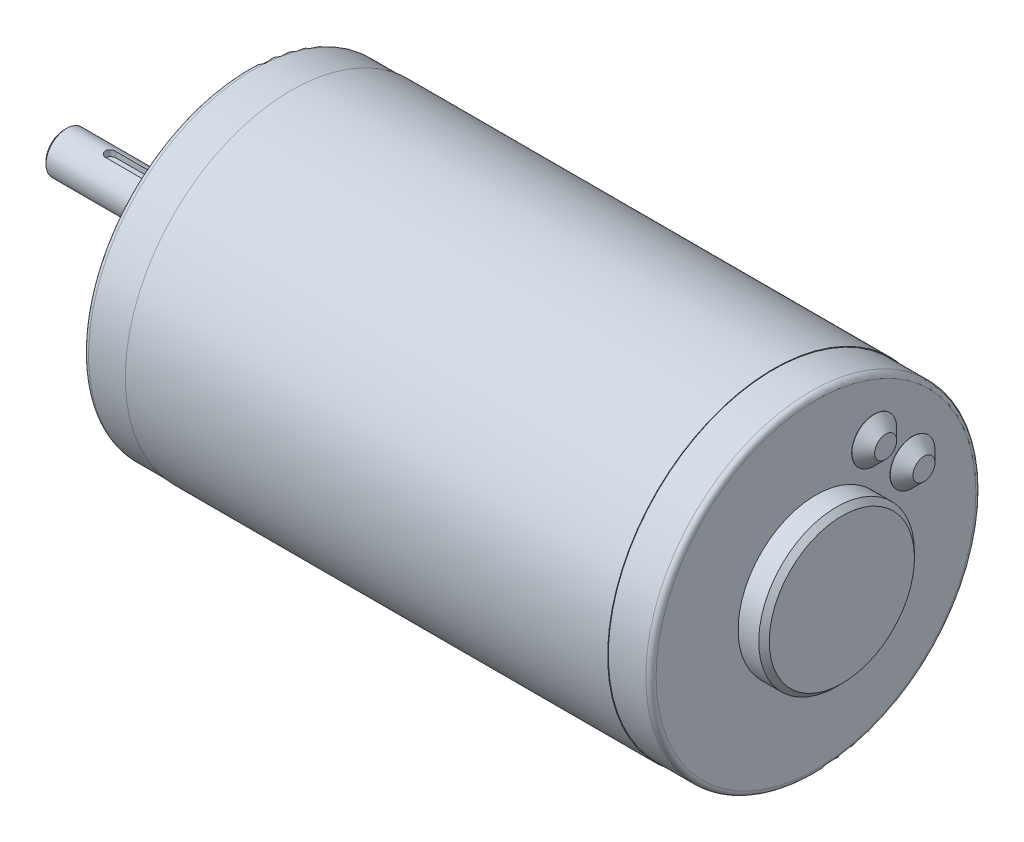
ISO-10303-21;
HEADER;
FILE_DESCRIPTION(('STEP AP214'),'2;1');
FILE_NAME('part.step','',(''),(''),'','','');
FILE_SCHEMA(('AUTOMOTIVE_DESIGN { 1 0 10303 214 1 1 1 1 }'));
ENDSEC;
DATA;
#1=APPLICATION_CONTEXT('core data for automotive mechanical design processes');
#2=APPLICATION_PROTOCOL_DEFINITION('international standard','automotive_design',2000,#1);
#3=PRODUCT_CONTEXT('',#1,'mechanical');
#4=PRODUCT('Part','Part','',(#3));
#5=PRODUCT_RELATED_PRODUCT_CATEGORY('part','',(#4));
#6=PRODUCT_DEFINITION_FORMATION('','',#4);
#7=PRODUCT_DEFINITION_CONTEXT('part definition',#1,'design');
#8=PRODUCT_DEFINITION('design','',#6,#7);
#9=PRODUCT_DEFINITION_SHAPE('','',#8);
#10=(LENGTH_UNIT() NAMED_UNIT(*) SI_UNIT(.MILLI.,.METRE.));
#11=(NAMED_UNIT(*) PLANE_ANGLE_UNIT() SI_UNIT($,.RADIAN.));
#12=(NAMED_UNIT(*) SI_UNIT($,.STERADIAN.) SOLID_ANGLE_UNIT());
#13=UNCERTAINTY_MEASURE_WITH_UNIT(LENGTH_MEASURE(1.E-05),#10,'distance_accuracy_value','');
#14=(GEOMETRIC_REPRESENTATION_CONTEXT(3) GLOBAL_UNCERTAINTY_ASSIGNED_CONTEXT((#13)) GLOBAL_UNIT_ASSIGNED_CONTEXT((#10,
#11,#12)) REPRESENTATION_CONTEXT('',''));
#15=CARTESIAN_POINT('',(0.,0.,0.));
#16=DIRECTION('',(0.,0.,1.));
#17=DIRECTION('',(1.,0.,0.));
#18=AXIS2_PLACEMENT_3D('',#15,#16,#17);
#19=CARTESIAN_POINT('',(-27.6,2.79999999999999,-1.));
#20=DIRECTION('',(0.,-1.,0.));
#21=DIRECTION('',(0.,0.,-1.));
#22=AXIS2_PLACEMENT_3D('',#19,#20,#21);
#23=PLANE('',#22);
#24=CARTESIAN_POINT('',(-7.1,2.79999999999999,0.));
#25=DIRECTION('',(0.,1.,0.));
#26=DIRECTION('',(0.,0.,1.));
#27=AXIS2_PLACEMENT_3D('',#24,#25,#26);
#28=CIRCLE('',#27,1.);
#29=CARTESIAN_POINT('',(-7.1,2.79999999999999,1.));
#30=VERTEX_POINT('',#29);
#31=CARTESIAN_POINT('',(-7.1,2.79999999999999,-1.));
#32=VERTEX_POINT('',#31);
#33=EDGE_CURVE('E80',#30,#32,#28,.T.);
#34=ORIENTED_EDGE('',*,*,#33,.T.);
#35=DIRECTION('',(1.,0.,0.));
#36=VECTOR('',#35,1.);
#37=CARTESIAN_POINT('',(-27.6,2.79999999999999,-1.));
#38=LINE('',#37,#36);
#39=CARTESIAN_POINT('',(-26.6,2.79999999999999,-1.));
#40=VERTEX_POINT('',#39);
#41=EDGE_CURVE('E75',#40,#32,#38,.T.);
#42=ORIENTED_EDGE('',*,*,#41,.F.);
#43=CARTESIAN_POINT('',(-26.6,2.79999999999999,0.));
#44=DIRECTION('',(0.,-1.,0.));
#45=DIRECTION('',(0.,0.,-1.));
#46=AXIS2_PLACEMENT_3D('',#43,#44,#45);
#47=CIRCLE('',#46,1.);
#48=CARTESIAN_POINT('',(-26.6,2.79999999999999,1.));
#49=VERTEX_POINT('',#48);
#50=EDGE_CURVE('E77',#40,#49,#47,.F.);
#51=ORIENTED_EDGE('',*,*,#50,.T.);
#52=DIRECTION('',(1.,0.,0.));
#53=VECTOR('',#52,1.);
#54=CARTESIAN_POINT('',(-27.6,2.79999999999999,1.));
#55=LINE('',#54,#53);
#56=EDGE_CURVE('E103',#49,#30,#55,.T.);
#57=ORIENTED_EDGE('',*,*,#56,.T.);
#58=EDGE_LOOP('',(#34,#42,#51,#57));
#59=FACE_BOUND('',#58,.T.);
#60=ADVANCED_FACE('F17',(#59),#23,.F.);
#61=CARTESIAN_POINT('',(-35.6,0.,0.));
#62=DIRECTION('',(-1.,0.,0.));
#63=DIRECTION('',(0.,0.,1.));
#64=AXIS2_PLACEMENT_3D('',#61,#62,#63);
#65=PLANE('',#64);
#66=CARTESIAN_POINT('',(-35.6000000000449,0.,0.));
#67=DIRECTION('',(1.,0.,0.));
#68=DIRECTION('',(0.,0.,-1.));
#69=AXIS2_PLACEMENT_3D('',#66,#67,#68);
#70=CIRCLE('',#69,3.49999999997408);
#71=CARTESIAN_POINT('',(-35.6000000000449,0.,-3.49999999997408));
#72=VERTEX_POINT('',#71);
#73=EDGE_CURVE('E325',#72,#72,#70,.T.);
#74=ORIENTED_EDGE('',*,*,#73,.F.);
#75=EDGE_LOOP('',(#74));
#76=FACE_BOUND('',#75,.T.);
#77=ADVANCED_FACE('F576',(#76),#65,.T.);
#78=CARTESIAN_POINT('',(-26.6,3.87298334620741,0.));
#79=DIRECTION('',(0.,-1.,0.));
#80=DIRECTION('',(0.,0.,-1.));
#81=AXIS2_PLACEMENT_3D('',#78,#79,#80);
#82=CYLINDRICAL_SURFACE('',#81,1.);
#83=CARTESIAN_POINT('',(-26.6,3.87298334620741,1.));
#84=CARTESIAN_POINT('',(-26.6276629851065,3.87298148580177,1.00000033749611));
#85=CARTESIAN_POINT('',(-26.6553122630182,3.8732800994947,0.998851407375366));
#86=CARTESIAN_POINT('',(-26.7104040353036,3.87445904774558,0.994271295395754));
#87=CARTESIAN_POINT('',(-26.7378465636871,3.87533928441687,0.99084049757268));
#88=CARTESIAN_POINT('',(-26.8194531732088,3.87881710972053,0.977175239382527));
#89=CARTESIAN_POINT('',(-26.8730564684822,3.88225203148808,0.963567695172493));
#90=CARTESIAN_POINT('',(-26.977124673782,3.89095422588002,0.927798076247996));
#91=CARTESIAN_POINT('',(-27.0275898782129,3.89622132630929,0.905636805423835));
#92=CARTESIAN_POINT('',(-27.1241114486473,3.90799134471939,0.853415378025865));
#93=CARTESIAN_POINT('',(-27.170166627891,3.91449459395647,0.823353103356933));
#94=CARTESIAN_POINT('',(-27.2575438819061,3.92816262398025,0.755484471828068));
#95=CARTESIAN_POINT('',(-27.2987548862455,3.93533791028915,0.717537268783974));
#96=CARTESIAN_POINT('',(-27.3743020894827,3.94945104396193,0.635275780516228));
#97=CARTESIAN_POINT('',(-27.4086371894679,3.95638885322537,0.590960479478829));
#98=CARTESIAN_POINT('',(-27.4699110016186,3.96936182283248,0.496456899401689));
#99=CARTESIAN_POINT('',(-27.496739895984,3.9753830468173,0.446195340334472));
#100=CARTESIAN_POINT('',(-27.5415247341967,3.98572346250588,0.341702590842916));
#101=CARTESIAN_POINT('',(-27.5594824242998,3.990042989147,0.287472184083007));
#102=CARTESIAN_POINT('',(-27.5856589927774,3.99641900005128,0.177744108525158));
#103=CARTESIAN_POINT('',(-27.5940676724228,3.998519529013,0.122294322002856));
#104=CARTESIAN_POINT('',(-27.6015033715433,4.00037438150815,0.0107327756816783));
#105=CARTESIAN_POINT('',(-27.6005315701923,4.00012899993444,-0.0453789000287066));
#106=CARTESIAN_POINT('',(-27.5893700363145,3.99735237365735,-0.155352492972097));
#107=CARTESIAN_POINT('',(-27.5793853834005,3.9948719867736,-0.209236701739855));
#108=CARTESIAN_POINT('',(-27.5508113208172,3.98796330636495,-0.31453871108434));
#109=CARTESIAN_POINT('',(-27.5322215304314,3.98353492665556,-0.365956402423988));
#110=CARTESIAN_POINT('',(-27.4867987193293,3.97314997761798,-0.46540728602454));
#111=CARTESIAN_POINT('',(-27.4598926057672,3.96717993827555,-0.513405629602248));
#112=CARTESIAN_POINT('',(-27.3986568701665,3.95435945541919,-0.604276631230015));
#113=CARTESIAN_POINT('',(-27.3643261297468,3.94750887933198,-0.64714851556229));
#114=CARTESIAN_POINT('',(-27.2881210879187,3.93345566022865,-0.727769389708492));
#115=CARTESIAN_POINT('',(-27.2460683634602,3.92624850477685,-0.765349103054128));
#116=CARTESIAN_POINT('',(-27.1561701330723,3.91246168284006,-0.832969575186237));
#117=CARTESIAN_POINT('',(-27.1083230467164,3.90588218842993,-0.863008270245062));
#118=CARTESIAN_POINT('',(-27.0078544021762,3.89407813586325,-0.914804709285962));
#119=CARTESIAN_POINT('',(-26.9552085351039,3.88886106009136,-0.936517017887269));
#120=CARTESIAN_POINT('',(-26.8468830715817,3.88047058807055,-0.970702351849828));
#121=CARTESIAN_POINT('',(-26.7912081448502,3.87729413761435,-0.983189189212132));
#122=CARTESIAN_POINT('',(-26.7125426192411,3.87455290681524,-0.993904635150938));
#123=CARTESIAN_POINT('',(-26.6900802967868,3.87396523110859,-0.996190790966708));
#124=CARTESIAN_POINT('',(-26.6450822100907,3.87318062488974,-0.999236757697394));
#125=CARTESIAN_POINT('',(-26.6225466240447,3.87298306219461,-0.999999038096045));
#126=CARTESIAN_POINT('',(-26.6,3.87298334620741,-1.));
#127=B_SPLINE_CURVE_WITH_KNOTS('',3,(#83,#84,#85,#86,#87,#88,#89,#90,#91,#92,#93,#94,#95,#96,
#97,#98,#99,#100,#101,#102,#103,#104,#105,#106,#107,#108,#109,#110,#111,#112,#113,#114,#115,
#116,#117,#118,#119,#120,#121,#122,#123,#124,#125,#126),.UNSPECIFIED.,.F.,.F.,(4,2,2,2,2,2,2,2,
2,2,2,2,2,2,2,2,2,2,2,2,2,4),(0.,0.0829365303397693,0.16585910608465,0.331229963080318,
0.496585282091499,0.661984974726751,0.830641897427977,0.999325753539196,1.17036187098235,
1.34136430732425,1.50890481515325,1.67642426256639,1.84022545479276,2.00403389475838,
2.16932509450376,2.33464120964329,2.50441429534542,2.67423379180967,2.84496720161068,
3.01544447539986,3.08315848722648,3.15076267731671),.UNSPECIFIED.);
#128=CARTESIAN_POINT('',(-26.6,3.87298334620741,1.));
#129=VERTEX_POINT('',#128);
#130=CARTESIAN_POINT('',(-26.6,3.87298334620741,-1.));
#131=VERTEX_POINT('',#130);
#132=EDGE_CURVE('E161',#129,#131,#127,.T.);
#133=ORIENTED_EDGE('',*,*,#132,.F.);
#134=DIRECTION('',(0.,1.,0.));
#135=VECTOR('',#134,1.);
#136=CARTESIAN_POINT('',(-26.6,2.79999999999999,1.));
#137=LINE('',#136,#135);
#138=EDGE_CURVE('E90',#129,#49,#137,.F.);
#139=ORIENTED_EDGE('',*,*,#138,.T.);
#140=ORIENTED_EDGE('',*,*,#50,.F.);
#141=DIRECTION('',(0.,1.,0.));
#142=VECTOR('',#141,1.);
#143=CARTESIAN_POINT('',(-26.6,2.79999999999999,-1.));
#144=LINE('',#143,#142);
#145=EDGE_CURVE('E84',#131,#40,#144,.F.);
#146=ORIENTED_EDGE('',*,*,#145,.F.);
#147=EDGE_LOOP('',(#133,#139,#140,#146));
#148=FACE_BOUND('',#147,.T.);
#149=ADVANCED_FACE('F87',(#148),#82,.F.);
#150=CARTESIAN_POINT('',(-27.6,2.79999999999999,-1.));
#151=DIRECTION('',(0.,0.,1.));
#152=DIRECTION('',(1.,0.,0.));
#153=AXIS2_PLACEMENT_3D('',#150,#151,#152);
#154=PLANE('',#153);
#155=DIRECTION('',(1.,0.,0.));
#156=VECTOR('',#155,1.);
#157=CARTESIAN_POINT('',(0.,3.87298334620741,-1.));
#158=LINE('',#157,#156);
#159=CARTESIAN_POINT('',(-7.1,3.87298334620741,-1.));
#160=VERTEX_POINT('',#159);
#161=EDGE_CURVE('E95',#131,#160,#158,.T.);
#162=ORIENTED_EDGE('',*,*,#161,.F.);
#163=ORIENTED_EDGE('',*,*,#145,.T.);
#164=ORIENTED_EDGE('',*,*,#41,.T.);
#165=DIRECTION('',(0.,1.,0.));
#166=VECTOR('',#165,1.);
#167=CARTESIAN_POINT('',(-7.1,2.79999999999999,-1.));
#168=LINE('',#167,#166);
#169=EDGE_CURVE('E98',#32,#160,#168,.T.);
#170=ORIENTED_EDGE('',*,*,#169,.T.);
#171=EDGE_LOOP('',(#162,#163,#164,#170));
#172=FACE_BOUND('',#171,.T.);
#173=ADVANCED_FACE('F93',(#172),#154,.T.);
#174=CARTESIAN_POINT('',(-7.1,2.79999999999999,0.));
#175=DIRECTION('',(0.,1.,0.));
#176=DIRECTION('',(0.,0.,1.));
#177=AXIS2_PLACEMENT_3D('',#174,#175,#176);
#178=CYLINDRICAL_SURFACE('',#177,1.);
#179=ORIENTED_EDGE('',*,*,#33,.F.);
#180=DIRECTION('',(0.,1.,0.));
#181=VECTOR('',#180,1.);
#182=CARTESIAN_POINT('',(-7.1,2.79999999999999,1.));
#183=LINE('',#182,#181);
#184=CARTESIAN_POINT('',(-7.1,3.87298334620741,1.));
#185=VERTEX_POINT('',#184);
#186=EDGE_CURVE('E104',#30,#185,#183,.T.);
#187=ORIENTED_EDGE('',*,*,#186,.T.);
#188=CARTESIAN_POINT('',(-7.1,3.87298334620741,-1.));
#189=CARTESIAN_POINT('',(-7.07233701489346,3.87298148580177,-1.00000033749611));
#190=CARTESIAN_POINT('',(-7.04468773698177,3.8732800994947,-0.998851407375366));
#191=CARTESIAN_POINT('',(-6.98959596469644,3.87445904774558,-0.994271295395754));
#192=CARTESIAN_POINT('',(-6.96215343631291,3.87533928441687,-0.990840497572679));
#193=CARTESIAN_POINT('',(-6.88054682679116,3.87881710972053,-0.977175239382527));
#194=CARTESIAN_POINT('',(-6.82694353151779,3.88225203148808,-0.963567695172494));
#195=CARTESIAN_POINT('',(-6.72287532621804,3.89095422588002,-0.927798076247997));
#196=CARTESIAN_POINT('',(-6.67241012178715,3.89622132630929,-0.905636805423836));
#197=CARTESIAN_POINT('',(-6.57588855135267,3.90799134471939,-0.853415378025865));
#198=CARTESIAN_POINT('',(-6.52983337210904,3.91449459395647,-0.823353103356933));
#199=CARTESIAN_POINT('',(-6.4424561180939,3.92816262398025,-0.755484471828069));
#200=CARTESIAN_POINT('',(-6.40124511375448,3.93533791028915,-0.717537268783976));
#201=CARTESIAN_POINT('',(-6.3256979105173,3.94945104396193,-0.63527578051623));
#202=CARTESIAN_POINT('',(-6.29136281053206,3.95638885322537,-0.590960479478831));
#203=CARTESIAN_POINT('',(-6.23008899838136,3.96936182283248,-0.496456899401691));
#204=CARTESIAN_POINT('',(-6.20326010401603,3.9753830468173,-0.446195340334474));
#205=CARTESIAN_POINT('',(-6.1584752658033,3.98572346250588,-0.341702590842919));
#206=CARTESIAN_POINT('',(-6.14051757570017,3.990042989147,-0.28747218408301));
#207=CARTESIAN_POINT('',(-6.11434100722257,3.99641900005128,-0.17774410852516));
#208=CARTESIAN_POINT('',(-6.10593232757718,3.998519529013,-0.122294322002858));
#209=CARTESIAN_POINT('',(-6.09849662845671,4.00037438150815,-0.0107327756816796));
#210=CARTESIAN_POINT('',(-6.09946842980766,4.00012899993444,0.0453789000287056));
#211=CARTESIAN_POINT('',(-6.11062996368545,3.99735237365735,0.155352492972096));
#212=CARTESIAN_POINT('',(-6.12061461659948,3.9948719867736,0.209236701739855));
#213=CARTESIAN_POINT('',(-6.14918867918275,3.98796330636495,0.31453871108434));
#214=CARTESIAN_POINT('',(-6.16777846956858,3.98353492665556,0.365956402423988));
#215=CARTESIAN_POINT('',(-6.21320128067065,3.97314997761798,0.465407286024539));
#216=CARTESIAN_POINT('',(-6.24010739423284,3.96717993827555,0.513405629602249));
#217=CARTESIAN_POINT('',(-6.30134312983347,3.95435945541919,0.604276631230014));
#218=CARTESIAN_POINT('',(-6.33567387025322,3.94750887933198,0.647148515562289));
#219=CARTESIAN_POINT('',(-6.41187891208131,3.93345566022865,0.72776938970849));
#220=CARTESIAN_POINT('',(-6.45393163653982,3.92624850477685,0.765349103054127));
#221=CARTESIAN_POINT('',(-6.54382986692774,3.91246168284006,0.832969575186237));
#222=CARTESIAN_POINT('',(-6.59167695328356,3.90588218842993,0.863008270245062));
#223=CARTESIAN_POINT('',(-6.69214559782377,3.89407813586325,0.914804709285962));
#224=CARTESIAN_POINT('',(-6.74479146489609,3.88886106009136,0.936517017887269));
#225=CARTESIAN_POINT('',(-6.85311692841829,3.88047058807055,0.970702351849828));
#226=CARTESIAN_POINT('',(-6.90879185514984,3.87729413761435,0.983189189212131));
#227=CARTESIAN_POINT('',(-6.98745738075891,3.87455290681524,0.993904635150938));
#228=CARTESIAN_POINT('',(-7.00991970321318,3.87396523110859,0.996190790966708));
#229=CARTESIAN_POINT('',(-7.05491778990932,3.87318062488974,0.999236757697394));
#230=CARTESIAN_POINT('',(-7.07745337595529,3.8729830621946,0.999999038096045));
#231=CARTESIAN_POINT('',(-7.1,3.87298334620741,1.));
#232=B_SPLINE_CURVE_WITH_KNOTS('',3,(#188,#189,#190,#191,#192,#193,#194,#195,#196,#197,#198,
#199,#200,#201,#202,#203,#204,#205,#206,#207,#208,#209,#210,#211,#212,#213,#214,#215,#216,#217,
#218,#219,#220,#221,#222,#223,#224,#225,#226,#227,#228,#229,#230,#231),.UNSPECIFIED.,.F.,.F.,(4,
2,2,2,2,2,2,2,2,2,2,2,2,2,2,2,2,2,2,2,2,4),(0.,0.0829365303397684,0.165859106084651,
0.331229963080317,0.496585282091498,0.661984974726749,0.830641897427974,0.999325753539193,
1.17036187098235,1.34136430732424,1.50890481515325,1.67642426256639,1.84022545479276,
2.00403389475838,2.16932509450376,2.33464120964329,2.50441429534542,2.67423379180967,
2.84496720161068,3.01544447539986,3.08315848722648,3.15076267731671),.UNSPECIFIED.);
#233=EDGE_CURVE('E152',#160,#185,#232,.T.);
#234=ORIENTED_EDGE('',*,*,#233,.F.);
#235=ORIENTED_EDGE('',*,*,#169,.F.);
#236=EDGE_LOOP('',(#179,#187,#234,#235));
#237=FACE_BOUND('',#236,.T.);
#238=ADVANCED_FACE('F167',(#237),#178,.F.);
#239=CARTESIAN_POINT('',(-27.6,2.79999999999999,1.));
#240=DIRECTION('',(0.,0.,1.));
#241=DIRECTION('',(1.,0.,0.));
#242=AXIS2_PLACEMENT_3D('',#239,#240,#241);
#243=PLANE('',#242);
#244=ORIENTED_EDGE('',*,*,#186,.F.);
#245=ORIENTED_EDGE('',*,*,#56,.F.);
#246=ORIENTED_EDGE('',*,*,#138,.F.);
#247=DIRECTION('',(1.,0.,0.));
#248=VECTOR('',#247,1.);
#249=CARTESIAN_POINT('',(0.,3.87298334620741,1.));
#250=LINE('',#249,#248);
#251=EDGE_CURVE('E160',#185,#129,#250,.F.);
#252=ORIENTED_EDGE('',*,*,#251,.F.);
#253=EDGE_LOOP('',(#244,#245,#246,#252));
#254=FACE_BOUND('',#253,.T.);
#255=ADVANCED_FACE('F182',(#254),#243,.F.);
#256=CARTESIAN_POINT('',(-35.0999999999999,0.,0.));
#257=DIRECTION('',(1.,0.,0.));
#258=DIRECTION('',(0.,0.,-1.));
#259=AXIS2_PLACEMENT_3D('',#256,#257,#258);
#260=CONICAL_SURFACE('',#259,3.99999999996226,0.785398163340605);
#261=ORIENTED_EDGE('',*,*,#73,.T.);
#262=EDGE_LOOP('',(#261));
#263=FACE_BOUND('',#262,.T.);
#264=CARTESIAN_POINT('',(-35.1,0.,0.));
#265=DIRECTION('',(1.,0.,0.));
#266=DIRECTION('',(0.,0.,-1.));
#267=AXIS2_PLACEMENT_3D('',#264,#265,#266);
#268=CIRCLE('',#267,4.);
#269=CARTESIAN_POINT('',(-35.1,0.,-4.));
#270=VERTEX_POINT('',#269);
#271=EDGE_CURVE('E151',#270,#270,#268,.T.);
#272=ORIENTED_EDGE('',*,*,#271,.F.);
#273=EDGE_LOOP('',(#272));
#274=FACE_BOUND('',#273,.T.);
#275=ADVANCED_FACE('F177',(#263,#274),#260,.T.);
#276=CARTESIAN_POINT('',(0.,0.,0.));
#277=DIRECTION('',(1.,0.,0.));
#278=DIRECTION('',(0.,0.,-1.));
#279=AXIS2_PLACEMENT_3D('',#276,#277,#278);
#280=CYLINDRICAL_SURFACE('',#279,4.);
#281=ORIENTED_EDGE('',*,*,#271,.T.);
#282=EDGE_LOOP('',(#281));
#283=FACE_BOUND('',#282,.T.);
#284=CARTESIAN_POINT('',(-4.,0.,0.));
#285=DIRECTION('',(1.,0.,0.));
#286=DIRECTION('',(0.,0.,-1.));
#287=AXIS2_PLACEMENT_3D('',#284,#285,#286);
#288=CIRCLE('',#287,4.);
#289=CARTESIAN_POINT('',(-4.,0.,-4.));
#290=VERTEX_POINT('',#289);
#291=EDGE_CURVE('E148',#290,#290,#288,.T.);
#292=ORIENTED_EDGE('',*,*,#291,.F.);
#293=EDGE_LOOP('',(#292));
#294=FACE_BOUND('',#293,.T.);
#295=ORIENTED_EDGE('',*,*,#233,.T.);
#296=ORIENTED_EDGE('',*,*,#251,.T.);
#297=ORIENTED_EDGE('',*,*,#132,.T.);
#298=ORIENTED_EDGE('',*,*,#161,.T.);
#299=EDGE_LOOP('',(#295,#296,#297,#298));
#300=FACE_BOUND('',#299,.T.);
#301=ADVANCED_FACE('F171',(#283,#294,#300),#280,.T.);
#302=CARTESIAN_POINT('',(-4.,4.,0.));
#303=DIRECTION('',(-1.,0.,0.));
#304=DIRECTION('',(0.,0.,1.));
#305=AXIS2_PLACEMENT_3D('',#302,#303,#304);
#306=PLANE('',#305);
#307=ORIENTED_EDGE('',*,*,#291,.T.);
#308=EDGE_LOOP('',(#307));
#309=FACE_BOUND('',#308,.T.);
#310=CARTESIAN_POINT('',(-4.,0.,0.));
#311=DIRECTION('',(1.,0.,0.));
#312=DIRECTION('',(0.,1.,0.));
#313=AXIS2_PLACEMENT_3D('',#310,#311,#312);
#314=CIRCLE('',#313,8.509);
#315=CARTESIAN_POINT('',(-4.,8.509,0.));
#316=VERTEX_POINT('',#315);
#317=EDGE_CURVE('E145',#316,#316,#314,.T.);
#318=ORIENTED_EDGE('',*,*,#317,.F.);
#319=EDGE_LOOP('',(#318));
#320=FACE_BOUND('',#319,.T.);
#321=ADVANCED_FACE('F176',(#309,#320),#306,.T.);
#322=CARTESIAN_POINT('',(111.8479,18.6070906828553,-11.2073596390943));
#323=DIRECTION('',(1.,0.,0.));
#324=DIRECTION('',(0.,0.,-1.));
#325=AXIS2_PLACEMENT_3D('',#322,#323,#324);
#326=PLANE('',#325);
#327=CARTESIAN_POINT('',(111.84789999993,18.6070906828553,-11.2073596390943));
#328=DIRECTION('',(-1.,0.,0.));
#329=DIRECTION('',(0.,-1.,0.));
#330=AXIS2_PLACEMENT_3D('',#327,#328,#329);
#331=CIRCLE('',#330,2.11800000003146);
#332=CARTESIAN_POINT('',(111.84789999993,16.4890906828238,-11.2073596390943));
#333=VERTEX_POINT('',#332);
#334=EDGE_CURVE('E142',#333,#333,#331,.T.);
#335=ORIENTED_EDGE('',*,*,#334,.F.);
#336=EDGE_LOOP('',(#335));
#337=FACE_BOUND('',#336,.T.);
#338=ADVANCED_FACE('F528',(#337),#326,.T.);
#339=CARTESIAN_POINT('',(114.6,15.0368,0.));
#340=DIRECTION('',(1.,0.,0.));
#341=DIRECTION('',(0.,0.,-1.));
#342=AXIS2_PLACEMENT_3D('',#339,#340,#341);
#343=PLANE('',#342);
#344=CARTESIAN_POINT('',(114.6,0.,0.));
#345=DIRECTION('',(-1.,0.,0.));
#346=DIRECTION('',(0.,-1.,0.));
#347=AXIS2_PLACEMENT_3D('',#344,#345,#346);
#348=CIRCLE('',#347,14.0208);
#349=CARTESIAN_POINT('',(114.6,-14.0208,0.));
#350=VERTEX_POINT('',#349);
#351=EDGE_CURVE('E139',#350,#350,#348,.T.);
#352=ORIENTED_EDGE('',*,*,#351,.F.);
#353=EDGE_LOOP('',(#352));
#354=FACE_BOUND('',#353,.T.);
#355=ADVANCED_FACE('F519',(#354),#343,.T.);
#356=CARTESIAN_POINT('',(111.8479,11.2073596390943,-18.6070906828553));
#357=DIRECTION('',(1.,0.,0.));
#358=DIRECTION('',(0.,0.,-1.));
#359=AXIS2_PLACEMENT_3D('',#356,#357,#358);
#360=PLANE('',#359);
#361=CARTESIAN_POINT('',(111.84789999993,11.2073596390943,-18.6070906828553));
#362=DIRECTION('',(-1.,0.,0.));
#363=DIRECTION('',(0.,0.,1.));
#364=AXIS2_PLACEMENT_3D('',#361,#362,#363);
#365=CIRCLE('',#364,2.1180000000021);
#366=CARTESIAN_POINT('',(111.84789999993,11.2073596390943,-16.4890906828532));
#367=VERTEX_POINT('',#366);
#368=EDGE_CURVE('E135',#367,#367,#365,.T.);
#369=ORIENTED_EDGE('',*,*,#368,.F.);
#370=EDGE_LOOP('',(#369));
#371=FACE_BOUND('',#370,.T.);
#372=ADVANCED_FACE('F510',(#371),#360,.T.);
#373=CARTESIAN_POINT('',(13.6143999999945,25.4,0.));
#374=DIRECTION('',(-1.,0.,0.));
#375=DIRECTION('',(0.,0.,1.));
#376=AXIS2_PLACEMENT_3D('',#373,#374,#375);
#377=CONICAL_SURFACE('',#376,2.01929999997219,1.02974425867198);
#378=CARTESIAN_POINT('',(14.827717847993,25.4,0.));
#379=VERTEX_POINT('',#378);
#380=VERTEX_LOOP('',#379);
#381=FACE_BOUND('',#380,.T.);
#382=CARTESIAN_POINT('',(13.6144,25.4,0.));
#383=DIRECTION('',(-1.,0.,0.));
#384=DIRECTION('',(0.,0.,1.));
#385=AXIS2_PLACEMENT_3D('',#382,#383,#384);
#386=CIRCLE('',#385,2.0193);
#387=CARTESIAN_POINT('',(13.6144,25.4,2.0193));
#388=VERTEX_POINT('',#387);
#389=EDGE_CURVE('E138',#388,#388,#386,.T.);
#390=ORIENTED_EDGE('',*,*,#389,.T.);
#391=EDGE_LOOP('',(#390));
#392=FACE_BOUND('',#391,.T.);
#393=ADVANCED_FACE('F501',(#381,#392),#377,.F.);
#394=CARTESIAN_POINT('',(13.6143999999945,-25.4,0.));
#395=DIRECTION('',(-1.,0.,0.));
#396=DIRECTION('',(0.,0.,1.));
#397=AXIS2_PLACEMENT_3D('',#394,#395,#396);
#398=CONICAL_SURFACE('',#397,2.01929999997219,1.02974425867198);
#399=CARTESIAN_POINT('',(14.827717847993,-25.4,0.));
#400=VERTEX_POINT('',#399);
#401=VERTEX_LOOP('',#400);
#402=FACE_BOUND('',#401,.T.);
#403=CARTESIAN_POINT('',(13.6144,-25.4,0.));
#404=DIRECTION('',(-1.,0.,0.));
#405=DIRECTION('',(0.,0.,1.));
#406=AXIS2_PLACEMENT_3D('',#403,#404,#405);
#407=CIRCLE('',#406,2.0193);
#408=CARTESIAN_POINT('',(13.6144,-25.4,2.0193));
#409=VERTEX_POINT('',#408);
#410=EDGE_CURVE('E315',#409,#409,#407,.T.);
#411=ORIENTED_EDGE('',*,*,#410,.T.);
#412=EDGE_LOOP('',(#411));
#413=FACE_BOUND('',#412,.T.);
#414=ADVANCED_FACE('F492',(#402,#413),#398,.F.);
#415=CARTESIAN_POINT('',(-2.984,0.,0.));
#416=DIRECTION('',(1.,0.,0.));
#417=DIRECTION('',(0.,1.,0.));
#418=AXIS2_PLACEMENT_3D('',#415,#416,#417);
#419=CONICAL_SURFACE('',#418,9.525,0.78539816339745);
#420=ORIENTED_EDGE('',*,*,#317,.T.);
#421=EDGE_LOOP('',(#420));
#422=FACE_BOUND('',#421,.T.);
#423=CARTESIAN_POINT('',(-2.984,0.,0.));
#424=DIRECTION('',(1.,0.,0.));
#425=DIRECTION('',(0.,0.,-1.));
#426=AXIS2_PLACEMENT_3D('',#423,#424,#425);
#427=CIRCLE('',#426,9.525);
#428=CARTESIAN_POINT('',(-2.984,0.,-9.525));
#429=VERTEX_POINT('',#428);
#430=EDGE_CURVE('E312',#429,#429,#427,.T.);
#431=ORIENTED_EDGE('',*,*,#430,.F.);
#432=EDGE_LOOP('',(#431));
#433=FACE_BOUND('',#432,.T.);
#434=ADVANCED_FACE('F483',(#422,#433),#419,.T.);
#435=CARTESIAN_POINT('',(109.647900000027,18.6070906828553,-11.2073596390943));
#436=DIRECTION('',(-1.,0.,0.));
#437=DIRECTION('',(0.,-1.,0.));
#438=AXIS2_PLACEMENT_3D('',#435,#436,#437);
#439=CONICAL_SURFACE('',#438,4.31799999987712,0.785398163384529);
#440=CARTESIAN_POINT('',(109.6479,18.6070906828553,-11.2073596390943));
#441=DIRECTION('',(-1.,0.,0.));
#442=DIRECTION('',(0.,0.,1.));
#443=AXIS2_PLACEMENT_3D('',#440,#441,#442);
#444=CIRCLE('',#443,4.318);
#445=CARTESIAN_POINT('',(109.6479,18.6070906828553,-6.88935963909434));
#446=VERTEX_POINT('',#445);
#447=EDGE_CURVE('E309',#446,#446,#444,.T.);
#448=ORIENTED_EDGE('',*,*,#447,.F.);
#449=EDGE_LOOP('',(#448));
#450=FACE_BOUND('',#449,.T.);
#451=ORIENTED_EDGE('',*,*,#334,.T.);
#452=EDGE_LOOP('',(#451));
#453=FACE_BOUND('',#452,.T.);
#454=ADVANCED_FACE('F474',(#450,#453),#439,.T.);
#455=CARTESIAN_POINT('',(113.584,0.,0.));
#456=DIRECTION('',(-1.,0.,0.));
#457=DIRECTION('',(0.,-1.,0.));
#458=AXIS2_PLACEMENT_3D('',#455,#456,#457);
#459=CONICAL_SURFACE('',#458,15.0368,0.785398163397441);
#460=ORIENTED_EDGE('',*,*,#351,.T.);
#461=EDGE_LOOP('',(#460));
#462=FACE_BOUND('',#461,.T.);
#463=CARTESIAN_POINT('',(113.584,0.,0.));
#464=DIRECTION('',(1.,0.,0.));
#465=DIRECTION('',(0.,0.,-1.));
#466=AXIS2_PLACEMENT_3D('',#463,#464,#465);
#467=CIRCLE('',#466,15.0368);
#468=CARTESIAN_POINT('',(113.584,0.,-15.0368));
#469=VERTEX_POINT('',#468);
#470=EDGE_CURVE('E306',#469,#469,#467,.F.);
#471=ORIENTED_EDGE('',*,*,#470,.F.);
#472=EDGE_LOOP('',(#471));
#473=FACE_BOUND('',#472,.T.);
#474=ADVANCED_FACE('F465',(#462,#473),#459,.T.);
#475=CARTESIAN_POINT('',(109.647900000084,11.2073596390943,-18.6070906828553));
#476=DIRECTION('',(-1.,0.,0.));
#477=DIRECTION('',(0.,0.,1.));
#478=AXIS2_PLACEMENT_3D('',#475,#476,#477);
#479=CONICAL_SURFACE('',#478,4.31799999990461,0.785398163410367);
#480=CARTESIAN_POINT('',(109.6479,11.2073596390943,-18.6070906828553));
#481=DIRECTION('',(-1.,0.,0.));
#482=DIRECTION('',(0.,0.,1.));
#483=AXIS2_PLACEMENT_3D('',#480,#481,#482);
#484=CIRCLE('',#483,4.318);
#485=CARTESIAN_POINT('',(109.6479,11.2073596390943,-14.2890906828553));
#486=VERTEX_POINT('',#485);
#487=EDGE_CURVE('E134',#486,#486,#484,.T.);
#488=ORIENTED_EDGE('',*,*,#487,.F.);
#489=EDGE_LOOP('',(#488));
#490=FACE_BOUND('',#489,.T.);
#491=ORIENTED_EDGE('',*,*,#368,.T.);
#492=EDGE_LOOP('',(#491));
#493=FACE_BOUND('',#492,.T.);
#494=ADVANCED_FACE('F456',(#490,#493),#479,.T.);
#495=CARTESIAN_POINT('',(0.,25.4,0.));
#496=DIRECTION('',(-1.,0.,0.));
#497=DIRECTION('',(0.,0.,1.));
#498=AXIS2_PLACEMENT_3D('',#495,#496,#497);
#499=CYLINDRICAL_SURFACE('',#498,2.0193);
#500=CARTESIAN_POINT('',(0.,25.4,0.));
#501=DIRECTION('',(-1.,0.,0.));
#502=DIRECTION('',(0.,0.,1.));
#503=AXIS2_PLACEMENT_3D('',#500,#501,#502);
#504=CIRCLE('',#503,2.0193);
#505=CARTESIAN_POINT('',(0.,25.4,2.0193));
#506=VERTEX_POINT('',#505);
#507=EDGE_CURVE('E131',#506,#506,#504,.F.);
#508=ORIENTED_EDGE('',*,*,#507,.F.);
#509=EDGE_LOOP('',(#508));
#510=FACE_BOUND('',#509,.T.);
#511=ORIENTED_EDGE('',*,*,#389,.F.);
#512=EDGE_LOOP('',(#511));
#513=FACE_BOUND('',#512,.T.);
#514=ADVANCED_FACE('F447',(#510,#513),#499,.F.);
#515=CARTESIAN_POINT('',(0.,-25.4,0.));
#516=DIRECTION('',(-1.,0.,0.));
#517=DIRECTION('',(0.,0.,1.));
#518=AXIS2_PLACEMENT_3D('',#515,#516,#517);
#519=CYLINDRICAL_SURFACE('',#518,2.0193);
#520=CARTESIAN_POINT('',(0.,-25.4,0.));
#521=DIRECTION('',(-1.,0.,0.));
#522=DIRECTION('',(0.,0.,1.));
#523=AXIS2_PLACEMENT_3D('',#520,#521,#522);
#524=CIRCLE('',#523,2.0193);
#525=CARTESIAN_POINT('',(0.,-25.4,2.0193));
#526=VERTEX_POINT('',#525);
#527=EDGE_CURVE('E128',#526,#526,#524,.F.);
#528=ORIENTED_EDGE('',*,*,#527,.F.);
#529=EDGE_LOOP('',(#528));
#530=FACE_BOUND('',#529,.T.);
#531=ORIENTED_EDGE('',*,*,#410,.F.);
#532=EDGE_LOOP('',(#531));
#533=FACE_BOUND('',#532,.T.);
#534=ADVANCED_FACE('F438',(#530,#533),#519,.F.);
#535=CARTESIAN_POINT('',(0.,0.,0.));
#536=DIRECTION('',(1.,0.,0.));
#537=DIRECTION('',(0.,0.,-1.));
#538=AXIS2_PLACEMENT_3D('',#535,#536,#537);
#539=CYLINDRICAL_SURFACE('',#538,9.525);
#540=ORIENTED_EDGE('',*,*,#430,.T.);
#541=EDGE_LOOP('',(#540));
#542=FACE_BOUND('',#541,.T.);
#543=CARTESIAN_POINT('',(0.,0.,0.));
#544=DIRECTION('',(1.,0.,0.));
#545=DIRECTION('',(0.,0.,-1.));
#546=AXIS2_PLACEMENT_3D('',#543,#544,#545);
#547=CIRCLE('',#546,9.525);
#548=CARTESIAN_POINT('',(0.,0.,-9.525));
#549=VERTEX_POINT('',#548);
#550=EDGE_CURVE('E125',#549,#549,#547,.T.);
#551=ORIENTED_EDGE('',*,*,#550,.F.);
#552=EDGE_LOOP('',(#551));
#553=FACE_BOUND('',#552,.T.);
#554=ADVANCED_FACE('F429',(#542,#553),#539,.T.);
#555=CARTESIAN_POINT('',(111.8479,18.6070906828553,-11.2073596390943));
#556=DIRECTION('',(-1.,0.,0.));
#557=DIRECTION('',(0.,0.,1.));
#558=AXIS2_PLACEMENT_3D('',#555,#556,#557);
#559=CYLINDRICAL_SURFACE('',#558,4.318);
#560=CARTESIAN_POINT('',(109.6,18.6070906828553,-11.2073596390943));
#561=DIRECTION('',(-1.,0.,0.));
#562=DIRECTION('',(0.,0.,1.));
#563=AXIS2_PLACEMENT_3D('',#560,#561,#562);
#564=CIRCLE('',#563,4.318);
#565=CARTESIAN_POINT('',(109.6,18.6070906828553,-6.88935963909434));
#566=VERTEX_POINT('',#565);
#567=EDGE_CURVE('E122',#566,#566,#564,.T.);
#568=ORIENTED_EDGE('',*,*,#567,.F.);
#569=EDGE_LOOP('',(#568));
#570=FACE_BOUND('',#569,.T.);
#571=ORIENTED_EDGE('',*,*,#447,.T.);
#572=EDGE_LOOP('',(#571));
#573=FACE_BOUND('',#572,.T.);
#574=ADVANCED_FACE('F420',(#570,#573),#559,.T.);
#575=CARTESIAN_POINT('',(0.,0.,0.));
#576=DIRECTION('',(1.,0.,0.));
#577=DIRECTION('',(0.,0.,-1.));
#578=AXIS2_PLACEMENT_3D('',#575,#576,#577);
#579=CYLINDRICAL_SURFACE('',#578,15.0368);
#580=CARTESIAN_POINT('',(109.6,0.,0.));
#581=DIRECTION('',(1.,0.,0.));
#582=DIRECTION('',(0.,0.,-1.));
#583=AXIS2_PLACEMENT_3D('',#580,#581,#582);
#584=CIRCLE('',#583,15.0368);
#585=CARTESIAN_POINT('',(109.6,0.,-15.0368));
#586=VERTEX_POINT('',#585);
#587=EDGE_CURVE('E119',#586,#586,#584,.F.);
#588=ORIENTED_EDGE('',*,*,#587,.F.);
#589=EDGE_LOOP('',(#588));
#590=FACE_BOUND('',#589,.T.);
#591=ORIENTED_EDGE('',*,*,#470,.T.);
#592=EDGE_LOOP('',(#591));
#593=FACE_BOUND('',#592,.T.);
#594=ADVANCED_FACE('F412',(#590,#593),#579,.T.);
#595=CARTESIAN_POINT('',(111.8479,11.2073596390943,-18.6070906828553));
#596=DIRECTION('',(-1.,0.,0.));
#597=DIRECTION('',(0.,0.,1.));
#598=AXIS2_PLACEMENT_3D('',#595,#596,#597);
#599=CYLINDRICAL_SURFACE('',#598,4.318);
#600=CARTESIAN_POINT('',(109.6,11.2073596390943,-18.6070906828553));
#601=DIRECTION('',(-1.,0.,0.));
#602=DIRECTION('',(0.,0.,1.));
#603=AXIS2_PLACEMENT_3D('',#600,#601,#602);
#604=CIRCLE('',#603,4.318);
#605=CARTESIAN_POINT('',(109.6,11.2073596390943,-14.2890906828553));
#606=VERTEX_POINT('',#605);
#607=EDGE_CURVE('E115',#606,#606,#604,.T.);
#608=ORIENTED_EDGE('',*,*,#607,.F.);
#609=EDGE_LOOP('',(#608));
#610=FACE_BOUND('',#609,.T.);
#611=ORIENTED_EDGE('',*,*,#487,.T.);
#612=EDGE_LOOP('',(#611));
#613=FACE_BOUND('',#612,.T.);
#614=ADVANCED_FACE('F404',(#610,#613),#599,.T.);
#615=CARTESIAN_POINT('',(0.,9.525,0.));
#616=DIRECTION('',(-1.,0.,0.));
#617=DIRECTION('',(0.,0.,1.));
#618=AXIS2_PLACEMENT_3D('',#615,#616,#617);
#619=PLANE('',#618);
#620=ORIENTED_EDGE('',*,*,#550,.T.);
#621=EDGE_LOOP('',(#620));
#622=FACE_BOUND('',#621,.T.);
#623=CARTESIAN_POINT('',(0.,0.,0.));
#624=DIRECTION('',(1.,0.,0.));
#625=DIRECTION('',(0.,0.,-1.));
#626=AXIS2_PLACEMENT_3D('',#623,#624,#625);
#627=CIRCLE('',#626,30.877);
#628=CARTESIAN_POINT('',(0.,0.,-30.877));
#629=VERTEX_POINT('',#628);
#630=CARTESIAN_POINT('',(0.,0.,30.877));
#631=VERTEX_POINT('',#630);
#632=EDGE_CURVE('E118',#629,#631,#627,.T.);
#633=ORIENTED_EDGE('',*,*,#632,.F.);
#634=CARTESIAN_POINT('',(0.,0.,0.));
#635=DIRECTION('',(1.,0.,0.));
#636=DIRECTION('',(0.,0.,1.));
#637=AXIS2_PLACEMENT_3D('',#634,#635,#636);
#638=CIRCLE('',#637,30.877);
#639=EDGE_CURVE('E285',#631,#629,#638,.T.);
#640=ORIENTED_EDGE('',*,*,#639,.F.);
#641=EDGE_LOOP('',(#633,#640));
#642=FACE_BOUND('',#641,.T.);
#643=ORIENTED_EDGE('',*,*,#527,.T.);
#644=EDGE_LOOP('',(#643));
#645=FACE_BOUND('',#644,.T.);
#646=ORIENTED_EDGE('',*,*,#507,.T.);
#647=EDGE_LOOP('',(#646));
#648=FACE_BOUND('',#647,.T.);
#649=ADVANCED_FACE('F251',(#622,#642,#645,#648),#619,.T.);
#650=CARTESIAN_POINT('',(109.6,31.877,0.));
#651=DIRECTION('',(1.,0.,0.));
#652=DIRECTION('',(0.,0.,-1.));
#653=AXIS2_PLACEMENT_3D('',#650,#651,#652);
#654=PLANE('',#653);
#655=ORIENTED_EDGE('',*,*,#607,.T.);
#656=EDGE_LOOP('',(#655));
#657=FACE_BOUND('',#656,.T.);
#658=ORIENTED_EDGE('',*,*,#587,.T.);
#659=EDGE_LOOP('',(#658));
#660=FACE_BOUND('',#659,.T.);
#661=CARTESIAN_POINT('',(109.6,0.,0.));
#662=DIRECTION('',(-1.,0.,0.));
#663=DIRECTION('',(0.,0.,1.));
#664=AXIS2_PLACEMENT_3D('',#661,#662,#663);
#665=CIRCLE('',#664,30.877);
#666=CARTESIAN_POINT('',(109.6,0.,30.877));
#667=VERTEX_POINT('',#666);
#668=CARTESIAN_POINT('',(109.6,0.,-30.877));
#669=VERTEX_POINT('',#668);
#670=EDGE_CURVE('E36',#667,#669,#665,.T.);
#671=ORIENTED_EDGE('',*,*,#670,.F.);
#672=CARTESIAN_POINT('',(109.6,0.,0.));
#673=DIRECTION('',(-1.,0.,0.));
#674=DIRECTION('',(0.,0.,-1.));
#675=AXIS2_PLACEMENT_3D('',#672,#673,#674);
#676=CIRCLE('',#675,30.877);
#677=EDGE_CURVE('E233',#669,#667,#676,.T.);
#678=ORIENTED_EDGE('',*,*,#677,.F.);
#679=EDGE_LOOP('',(#671,#678));
#680=FACE_BOUND('',#679,.T.);
#681=ORIENTED_EDGE('',*,*,#567,.T.);
#682=EDGE_LOOP('',(#681));
#683=FACE_BOUND('',#682,.T.);
#684=ADVANCED_FACE('F242',(#657,#660,#680,#683),#654,.T.);
#685=CARTESIAN_POINT('',(0.999999999999999,0.,0.));
#686=DIRECTION('',(-1.,0.,0.));
#687=DIRECTION('',(0.,0.,1.));
#688=AXIS2_PLACEMENT_3D('',#685,#686,#687);
#689=TOROIDAL_SURFACE('',#688,30.877,1.);
#690=CARTESIAN_POINT('',(0.999999999999999,0.,0.));
#691=DIRECTION('',(1.,0.,0.));
#692=DIRECTION('',(0.,0.,-1.));
#693=AXIS2_PLACEMENT_3D('',#690,#691,#692);
#694=CIRCLE('',#693,31.877);
#695=CARTESIAN_POINT('',(0.999999999999999,0.,-31.877));
#696=VERTEX_POINT('',#695);
#697=EDGE_CURVE('E231',#696,#696,#694,.T.);
#698=ORIENTED_EDGE('',*,*,#697,.F.);
#699=EDGE_LOOP('',(#698));
#700=FACE_BOUND('',#699,.T.);
#701=ORIENTED_EDGE('',*,*,#639,.T.);
#702=ORIENTED_EDGE('',*,*,#632,.T.);
#703=EDGE_LOOP('',(#701,#702));
#704=FACE_BOUND('',#703,.T.);
#705=ADVANCED_FACE('F220',(#700,#704),#689,.T.);
#706=CARTESIAN_POINT('',(108.6,0.,0.));
#707=DIRECTION('',(1.,0.,0.));
#708=DIRECTION('',(0.,0.,-1.));
#709=AXIS2_PLACEMENT_3D('',#706,#707,#708);
#710=TOROIDAL_SURFACE('',#709,30.877,1.);
#711=CARTESIAN_POINT('',(108.6,0.,0.));
#712=DIRECTION('',(1.,0.,0.));
#713=DIRECTION('',(0.,0.,-1.));
#714=AXIS2_PLACEMENT_3D('',#711,#712,#713);
#715=CIRCLE('',#714,31.877);
#716=CARTESIAN_POINT('',(108.6,0.,-31.877));
#717=VERTEX_POINT('',#716);
#718=EDGE_CURVE('E114',#717,#717,#715,.F.);
#719=ORIENTED_EDGE('',*,*,#718,.F.);
#720=EDGE_LOOP('',(#719));
#721=FACE_BOUND('',#720,.T.);
#722=ORIENTED_EDGE('',*,*,#677,.T.);
#723=ORIENTED_EDGE('',*,*,#670,.T.);
#724=EDGE_LOOP('',(#722,#723));
#725=FACE_BOUND('',#724,.T.);
#726=ADVANCED_FACE('F215',(#721,#725),#710,.T.);
#727=CARTESIAN_POINT('',(0.,0.,0.));
#728=DIRECTION('',(1.,0.,0.));
#729=DIRECTION('',(0.,0.,-1.));
#730=AXIS2_PLACEMENT_3D('',#727,#728,#729);
#731=CYLINDRICAL_SURFACE('',#730,31.877);
#732=ORIENTED_EDGE('',*,*,#697,.T.);
#733=EDGE_LOOP('',(#732));
#734=FACE_BOUND('',#733,.T.);
#735=CARTESIAN_POINT('',(8.2296,0.,0.));
#736=DIRECTION('',(1.,0.,0.));
#737=DIRECTION('',(0.,0.,-1.));
#738=AXIS2_PLACEMENT_3D('',#735,#736,#737);
#739=CIRCLE('',#738,31.877);
#740=CARTESIAN_POINT('',(8.2296,0.,-31.877));
#741=VERTEX_POINT('',#740);
#742=EDGE_CURVE('E111',#741,#741,#739,.T.);
#743=ORIENTED_EDGE('',*,*,#742,.F.);
#744=EDGE_LOOP('',(#743));
#745=FACE_BOUND('',#744,.T.);
#746=ADVANCED_FACE('F211',(#734,#745),#731,.T.);
#747=CARTESIAN_POINT('',(0.,0.,0.));
#748=DIRECTION('',(1.,0.,0.));
#749=DIRECTION('',(0.,0.,-1.));
#750=AXIS2_PLACEMENT_3D('',#747,#748,#749);
#751=CYLINDRICAL_SURFACE('',#750,31.877);
#752=CARTESIAN_POINT('',(101.3704,0.,0.));
#753=DIRECTION('',(1.,0.,0.));
#754=DIRECTION('',(0.,0.,-1.));
#755=AXIS2_PLACEMENT_3D('',#752,#753,#754);
#756=CIRCLE('',#755,31.877);
#757=CARTESIAN_POINT('',(101.3704,0.,-31.877));
#758=VERTEX_POINT('',#757);
#759=EDGE_CURVE('E108',#758,#758,#756,.F.);
#760=ORIENTED_EDGE('',*,*,#759,.F.);
#761=EDGE_LOOP('',(#760));
#762=FACE_BOUND('',#761,.T.);
#763=ORIENTED_EDGE('',*,*,#718,.T.);
#764=EDGE_LOOP('',(#763));
#765=FACE_BOUND('',#764,.T.);
#766=ADVANCED_FACE('F207',(#762,#765),#751,.T.);
#767=CARTESIAN_POINT('',(8.2296,31.877,0.));
#768=DIRECTION('',(-1.,0.,0.));
#769=DIRECTION('',(0.,0.,1.));
#770=AXIS2_PLACEMENT_3D('',#767,#768,#769);
#771=PLANE('',#770);
#772=CARTESIAN_POINT('',(8.2296,0.,0.));
#773=DIRECTION('',(1.,0.,0.));
#774=DIRECTION('',(0.,0.,-1.));
#775=AXIS2_PLACEMENT_3D('',#772,#773,#774);
#776=CIRCLE('',#775,32.004);
#777=CARTESIAN_POINT('',(8.2296,0.,-32.004));
#778=VERTEX_POINT('',#777);
#779=EDGE_CURVE('E28',#778,#778,#776,.T.);
#780=ORIENTED_EDGE('',*,*,#779,.F.);
#781=EDGE_LOOP('',(#780));
#782=FACE_BOUND('',#781,.T.);
#783=ORIENTED_EDGE('',*,*,#742,.T.);
#784=EDGE_LOOP('',(#783));
#785=FACE_BOUND('',#784,.T.);
#786=ADVANCED_FACE('F200',(#782,#785),#771,.T.);
#787=CARTESIAN_POINT('',(101.3704,32.004,0.));
#788=DIRECTION('',(1.,0.,0.));
#789=DIRECTION('',(0.,0.,-1.));
#790=AXIS2_PLACEMENT_3D('',#787,#788,#789);
#791=PLANE('',#790);
#792=ORIENTED_EDGE('',*,*,#759,.T.);
#793=EDGE_LOOP('',(#792));
#794=FACE_BOUND('',#793,.T.);
#795=CARTESIAN_POINT('',(101.3704,0.,0.));
#796=DIRECTION('',(1.,0.,0.));
#797=DIRECTION('',(0.,0.,-1.));
#798=AXIS2_PLACEMENT_3D('',#795,#796,#797);
#799=CIRCLE('',#798,32.004);
#800=CARTESIAN_POINT('',(101.3704,0.,-32.004));
#801=VERTEX_POINT('',#800);
#802=EDGE_CURVE('E11',#801,#801,#799,.F.);
#803=ORIENTED_EDGE('',*,*,#802,.F.);
#804=EDGE_LOOP('',(#803));
#805=FACE_BOUND('',#804,.T.);
#806=ADVANCED_FACE('F194',(#794,#805),#791,.T.);
#807=CARTESIAN_POINT('',(0.,0.,0.));
#808=DIRECTION('',(1.,0.,0.));
#809=DIRECTION('',(0.,0.,-1.));
#810=AXIS2_PLACEMENT_3D('',#807,#808,#809);
#811=CYLINDRICAL_SURFACE('',#810,32.004);
#812=ORIENTED_EDGE('',*,*,#802,.T.);
#813=EDGE_LOOP('',(#812));
#814=FACE_BOUND('',#813,.T.);
#815=ORIENTED_EDGE('',*,*,#779,.T.);
#816=EDGE_LOOP('',(#815));
#817=FACE_BOUND('',#816,.T.);
#818=ADVANCED_FACE('F192',(#814,#817),#811,.T.);
#819=CLOSED_SHELL('',(#60,#77,#149,#173,#238,#255,#275,#301,#321,#338,#355,#372,#393,#414,#434,
#454,#474,#494,#514,#534,#554,#574,#594,#614,#649,#684,#705,#726,#746,#766,#786,#806,#818));
#820=MANIFOLD_SOLID_BREP('B1',#819);
#821=ADVANCED_BREP_SHAPE_REPRESENTATION('',(#18,#820),#14);
#822=SHAPE_DEFINITION_REPRESENTATION(#9,#821);
ENDSEC;
END-ISO-10303-21;
